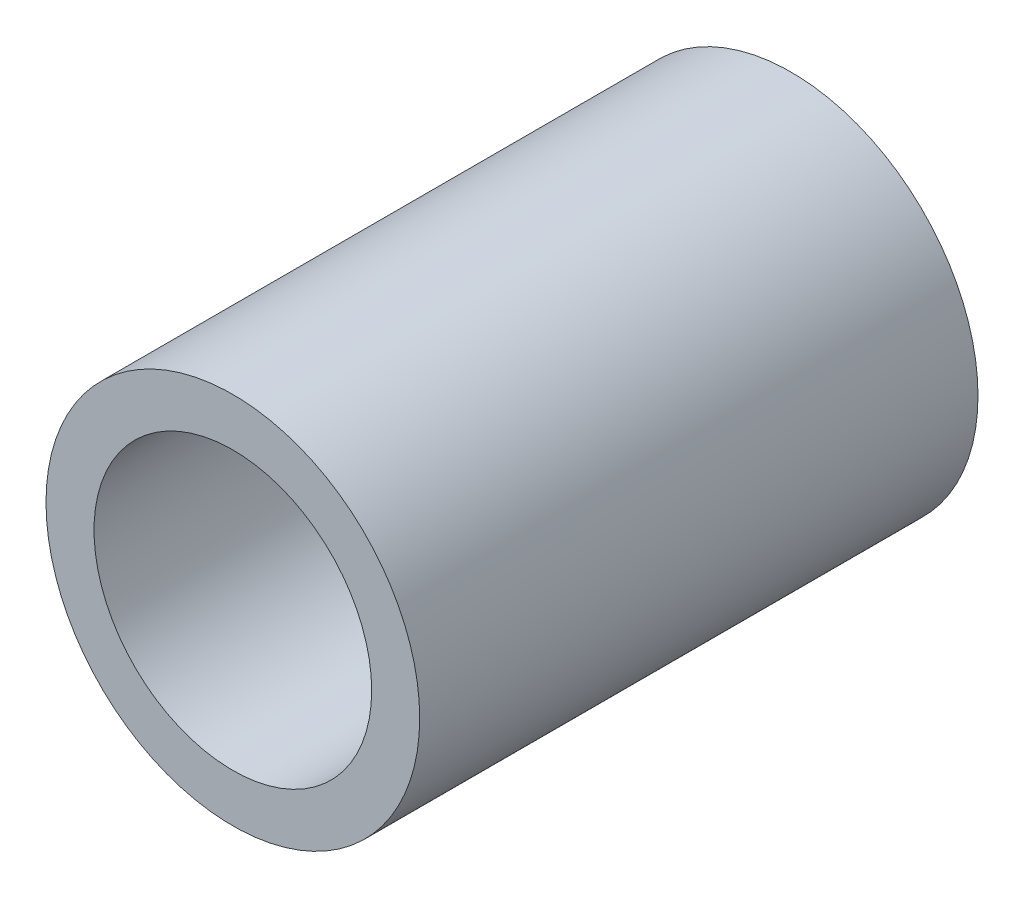
ISO-10303-21;
HEADER;
FILE_DESCRIPTION(('STEP AP214'),'2;1');
FILE_NAME('part.step','',(''),(''),'','','');
FILE_SCHEMA(('AUTOMOTIVE_DESIGN { 1 0 10303 214 1 1 1 1 }'));
ENDSEC;
DATA;
#1=APPLICATION_CONTEXT('core data for automotive mechanical design processes');
#2=APPLICATION_PROTOCOL_DEFINITION('international standard','automotive_design',2000,#1);
#3=PRODUCT_CONTEXT('',#1,'mechanical');
#4=PRODUCT('Part','Part','',(#3));
#5=PRODUCT_RELATED_PRODUCT_CATEGORY('part','',(#4));
#6=PRODUCT_DEFINITION_FORMATION('','',#4);
#7=PRODUCT_DEFINITION_CONTEXT('part definition',#1,'design');
#8=PRODUCT_DEFINITION('design','',#6,#7);
#9=PRODUCT_DEFINITION_SHAPE('','',#8);
#10=(LENGTH_UNIT() NAMED_UNIT(*) SI_UNIT(.MILLI.,.METRE.));
#11=(NAMED_UNIT(*) PLANE_ANGLE_UNIT() SI_UNIT($,.RADIAN.));
#12=(NAMED_UNIT(*) SI_UNIT($,.STERADIAN.) SOLID_ANGLE_UNIT());
#13=UNCERTAINTY_MEASURE_WITH_UNIT(LENGTH_MEASURE(1.E-05),#10,'distance_accuracy_value','');
#14=(GEOMETRIC_REPRESENTATION_CONTEXT(3) GLOBAL_UNCERTAINTY_ASSIGNED_CONTEXT((#13)) GLOBAL_UNIT_ASSIGNED_CONTEXT((#10,
#11,#12)) REPRESENTATION_CONTEXT('',''));
#15=CARTESIAN_POINT('',(0.,0.,0.));
#16=DIRECTION('',(0.,0.,1.));
#17=DIRECTION('',(1.,0.,0.));
#18=AXIS2_PLACEMENT_3D('',#15,#16,#17);
#19=CARTESIAN_POINT('',(0.,0.,4.7625));
#20=DIRECTION('',(0.,0.,1.));
#21=DIRECTION('',(1.,0.,0.));
#22=AXIS2_PLACEMENT_3D('',#19,#20,#21);
#23=PLANE('',#22);
#24=CARTESIAN_POINT('',(0.,0.,4.7625));
#25=DIRECTION('',(0.,0.,1.));
#26=DIRECTION('',(1.,0.,0.));
#27=AXIS2_PLACEMENT_3D('',#24,#25,#26);
#28=CIRCLE('',#27,3.1877);
#29=CARTESIAN_POINT('',(3.1877,0.,4.7625));
#30=VERTEX_POINT('',#29);
#31=EDGE_CURVE('E10',#30,#30,#28,.T.);
#32=ORIENTED_EDGE('',*,*,#31,.T.);
#33=EDGE_LOOP('',(#32));
#34=FACE_BOUND('',#33,.T.);
#35=CARTESIAN_POINT('',(0.,0.,4.7625));
#36=DIRECTION('',(0.,0.,1.));
#37=DIRECTION('',(1.,0.,0.));
#38=AXIS2_PLACEMENT_3D('',#35,#36,#37);
#39=CIRCLE('',#38,2.36855);
#40=CARTESIAN_POINT('',(2.36855,0.,4.7625));
#41=VERTEX_POINT('',#40);
#42=EDGE_CURVE('E43',#41,#41,#39,.T.);
#43=ORIENTED_EDGE('',*,*,#42,.F.);
#44=EDGE_LOOP('',(#43));
#45=FACE_BOUND('',#44,.T.);
#46=ADVANCED_FACE('F32',(#34,#45),#23,.T.);
#47=CARTESIAN_POINT('',(0.,0.,-4.7625));
#48=DIRECTION('',(0.,0.,1.));
#49=DIRECTION('',(1.,0.,0.));
#50=AXIS2_PLACEMENT_3D('',#47,#48,#49);
#51=PLANE('',#50);
#52=CARTESIAN_POINT('',(0.,0.,-4.7625));
#53=DIRECTION('',(0.,0.,1.));
#54=DIRECTION('',(1.,0.,0.));
#55=AXIS2_PLACEMENT_3D('',#52,#53,#54);
#56=CIRCLE('',#55,3.1877);
#57=CARTESIAN_POINT('',(3.1877,0.,-4.7625));
#58=VERTEX_POINT('',#57);
#59=EDGE_CURVE('E36',#58,#58,#56,.T.);
#60=ORIENTED_EDGE('',*,*,#59,.F.);
#61=EDGE_LOOP('',(#60));
#62=FACE_BOUND('',#61,.T.);
#63=CARTESIAN_POINT('',(0.,0.,-4.7625));
#64=DIRECTION('',(0.,0.,1.));
#65=DIRECTION('',(1.,0.,0.));
#66=AXIS2_PLACEMENT_3D('',#63,#64,#65);
#67=CIRCLE('',#66,2.36855);
#68=CARTESIAN_POINT('',(2.36855,0.,-4.7625));
#69=VERTEX_POINT('',#68);
#70=EDGE_CURVE('E45',#69,#69,#67,.T.);
#71=ORIENTED_EDGE('',*,*,#70,.T.);
#72=EDGE_LOOP('',(#71));
#73=FACE_BOUND('',#72,.T.);
#74=ADVANCED_FACE('F55',(#62,#73),#51,.F.);
#75=CARTESIAN_POINT('',(0.,0.,4.7625));
#76=DIRECTION('',(0.,0.,-1.));
#77=DIRECTION('',(-1.,0.,0.));
#78=AXIS2_PLACEMENT_3D('',#75,#76,#77);
#79=CYLINDRICAL_SURFACE('',#78,3.1877);
#80=ORIENTED_EDGE('',*,*,#31,.F.);
#81=EDGE_LOOP('',(#80));
#82=FACE_BOUND('',#81,.T.);
#83=ORIENTED_EDGE('',*,*,#59,.T.);
#84=EDGE_LOOP('',(#83));
#85=FACE_BOUND('',#84,.T.);
#86=ADVANCED_FACE('F34',(#82,#85),#79,.T.);
#87=CARTESIAN_POINT('',(0.,0.,4.7625));
#88=DIRECTION('',(0.,0.,-1.));
#89=DIRECTION('',(-1.,0.,0.));
#90=AXIS2_PLACEMENT_3D('',#87,#88,#89);
#91=CYLINDRICAL_SURFACE('',#90,2.36855);
#92=ORIENTED_EDGE('',*,*,#42,.T.);
#93=EDGE_LOOP('',(#92));
#94=FACE_BOUND('',#93,.T.);
#95=ORIENTED_EDGE('',*,*,#70,.F.);
#96=EDGE_LOOP('',(#95));
#97=FACE_BOUND('',#96,.T.);
#98=ADVANCED_FACE('F51',(#94,#97),#91,.F.);
#99=CLOSED_SHELL('',(#46,#74,#86,#98));
#100=MANIFOLD_SOLID_BREP('B2',#99);
#101=ADVANCED_BREP_SHAPE_REPRESENTATION('',(#18,#100),#14);
#102=SHAPE_DEFINITION_REPRESENTATION(#9,#101);
ENDSEC;
END-ISO-10303-21;
